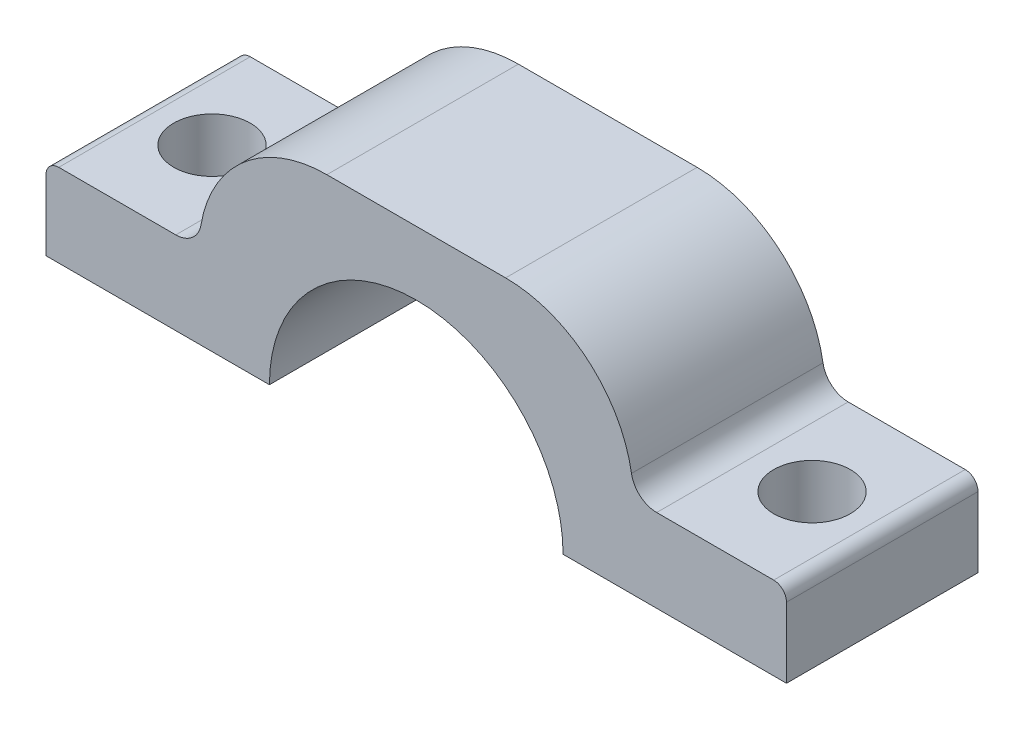
ISO-10303-21;
HEADER;
FILE_DESCRIPTION(('STEP AP214'),'2;1');
FILE_NAME('part.step','',(''),(''),'','','');
FILE_SCHEMA(('AUTOMOTIVE_DESIGN { 1 0 10303 214 1 1 1 1 }'));
ENDSEC;
DATA;
#1=APPLICATION_CONTEXT('core data for automotive mechanical design processes');
#2=APPLICATION_PROTOCOL_DEFINITION('international standard','automotive_design',2000,#1);
#3=PRODUCT_CONTEXT('',#1,'mechanical');
#4=PRODUCT('Part','Part','',(#3));
#5=PRODUCT_RELATED_PRODUCT_CATEGORY('part','',(#4));
#6=PRODUCT_DEFINITION_FORMATION('','',#4);
#7=PRODUCT_DEFINITION_CONTEXT('part definition',#1,'design');
#8=PRODUCT_DEFINITION('design','',#6,#7);
#9=PRODUCT_DEFINITION_SHAPE('','',#8);
#10=(LENGTH_UNIT() NAMED_UNIT(*) SI_UNIT(.MILLI.,.METRE.));
#11=(NAMED_UNIT(*) PLANE_ANGLE_UNIT() SI_UNIT($,.RADIAN.));
#12=(NAMED_UNIT(*) SI_UNIT($,.STERADIAN.) SOLID_ANGLE_UNIT());
#13=UNCERTAINTY_MEASURE_WITH_UNIT(LENGTH_MEASURE(1.E-05),#10,'distance_accuracy_value','');
#14=(GEOMETRIC_REPRESENTATION_CONTEXT(3) GLOBAL_UNCERTAINTY_ASSIGNED_CONTEXT((#13)) GLOBAL_UNIT_ASSIGNED_CONTEXT((#10,
#11,#12)) REPRESENTATION_CONTEXT('',''));
#15=CARTESIAN_POINT('',(0.,0.,0.));
#16=DIRECTION('',(0.,0.,1.));
#17=DIRECTION('',(1.,0.,0.));
#18=AXIS2_PLACEMENT_3D('',#15,#16,#17);
#19=CARTESIAN_POINT('',(17.,6.49999999999993,15.));
#20=DIRECTION('',(0.,-1.,0.));
#21=DIRECTION('',(1.,0.,0.));
#22=AXIS2_PLACEMENT_3D('',#19,#20,#21);
#23=PLANE('',#22);
#24=CARTESIAN_POINT('',(23.5,6.49999999999997,7.5));
#25=DIRECTION('',(0.,1.,0.));
#26=DIRECTION('',(0.,0.,1.));
#27=AXIS2_PLACEMENT_3D('',#24,#25,#26);
#28=CIRCLE('',#27,2.99999999999999);
#29=CARTESIAN_POINT('',(23.5,6.49999999999997,10.5));
#30=VERTEX_POINT('',#29);
#31=EDGE_CURVE('E286',#30,#30,#28,.T.);
#32=ORIENTED_EDGE('',*,*,#31,.F.);
#33=EDGE_LOOP('',(#32));
#34=FACE_BOUND('',#33,.T.);
#35=DIRECTION('',(-1.,0.,0.));
#36=VECTOR('',#35,1.);
#37=CARTESIAN_POINT('',(17.,6.49999999999993,15.));
#38=LINE('',#37,#36);
#39=CARTESIAN_POINT('',(28.,6.49999999999999,15.));
#40=VERTEX_POINT('',#39);
#41=CARTESIAN_POINT('',(18.8321595661993,6.49999999999994,15.));
#42=VERTEX_POINT('',#41);
#43=EDGE_CURVE('E144',#40,#42,#38,.T.);
#44=ORIENTED_EDGE('',*,*,#43,.F.);
#45=DIRECTION('',(0.,0.,-1.));
#46=VECTOR('',#45,1.);
#47=CARTESIAN_POINT('',(28.,6.49999999999999,15.));
#48=LINE('',#47,#46);
#49=CARTESIAN_POINT('',(28.,6.49999999999999,0.));
#50=VERTEX_POINT('',#49);
#51=EDGE_CURVE('E228',#40,#50,#48,.T.);
#52=ORIENTED_EDGE('',*,*,#51,.T.);
#53=DIRECTION('',(-1.,0.,0.));
#54=VECTOR('',#53,1.);
#55=CARTESIAN_POINT('',(17.,6.49999999999993,0.));
#56=LINE('',#55,#54);
#57=CARTESIAN_POINT('',(18.8321595661993,6.49999999999994,0.));
#58=VERTEX_POINT('',#57);
#59=EDGE_CURVE('E177',#50,#58,#56,.T.);
#60=ORIENTED_EDGE('',*,*,#59,.T.);
#61=DIRECTION('',(0.,0.,1.));
#62=VECTOR('',#61,1.);
#63=CARTESIAN_POINT('',(18.8321595661993,6.49999999999994,15.));
#64=LINE('',#63,#62);
#65=EDGE_CURVE('E212',#58,#42,#64,.T.);
#66=ORIENTED_EDGE('',*,*,#65,.T.);
#67=EDGE_LOOP('',(#44,#52,#60,#66));
#68=FACE_BOUND('',#67,.T.);
#69=ADVANCED_FACE('F32',(#34,#68),#23,.F.);
#70=CARTESIAN_POINT('',(7.,6.50000000000001,15.));
#71=DIRECTION('',(0.,0.,-1.));
#72=DIRECTION('',(-1.,0.,0.));
#73=AXIS2_PLACEMENT_3D('',#70,#71,#72);
#74=CYLINDRICAL_SURFACE('',#73,10.);
#75=CARTESIAN_POINT('',(7.,6.50000000000001,15.));
#76=DIRECTION('',(0.,0.,1.));
#77=DIRECTION('',(-1.,0.,0.));
#78=AXIS2_PLACEMENT_3D('',#75,#76,#77);
#79=CIRCLE('',#78,10.);
#80=CARTESIAN_POINT('',(16.8601329718327,8.16666666666662,15.));
#81=VERTEX_POINT('',#80);
#82=CARTESIAN_POINT('',(6.99999999999993,16.5,15.));
#83=VERTEX_POINT('',#82);
#84=EDGE_CURVE('E131',#81,#83,#79,.T.);
#85=ORIENTED_EDGE('',*,*,#84,.F.);
#86=DIRECTION('',(0.,0.,-1.));
#87=VECTOR('',#86,1.);
#88=CARTESIAN_POINT('',(16.8601329718327,8.16666666666662,15.));
#89=LINE('',#88,#87);
#90=CARTESIAN_POINT('',(16.8601329718327,8.16666666666662,0.));
#91=VERTEX_POINT('',#90);
#92=EDGE_CURVE('E153',#81,#91,#89,.T.);
#93=ORIENTED_EDGE('',*,*,#92,.T.);
#94=CARTESIAN_POINT('',(7.,6.50000000000001,0.));
#95=DIRECTION('',(0.,0.,1.));
#96=DIRECTION('',(-1.,0.,0.));
#97=AXIS2_PLACEMENT_3D('',#94,#95,#96);
#98=CIRCLE('',#97,10.);
#99=CARTESIAN_POINT('',(6.99999999999993,16.5,0.));
#100=VERTEX_POINT('',#99);
#101=EDGE_CURVE('E150',#91,#100,#98,.T.);
#102=ORIENTED_EDGE('',*,*,#101,.T.);
#103=DIRECTION('',(0.,0.,-1.));
#104=VECTOR('',#103,1.);
#105=CARTESIAN_POINT('',(6.99999999999993,16.5,15.));
#106=LINE('',#105,#104);
#107=EDGE_CURVE('E147',#83,#100,#106,.T.);
#108=ORIENTED_EDGE('',*,*,#107,.F.);
#109=EDGE_LOOP('',(#85,#93,#102,#108));
#110=FACE_BOUND('',#109,.T.);
#111=ADVANCED_FACE('F148',(#110),#74,.T.);
#112=CARTESIAN_POINT('',(-6.99999999999993,16.5,15.));
#113=DIRECTION('',(0.,-1.,0.));
#114=DIRECTION('',(1.,0.,0.));
#115=AXIS2_PLACEMENT_3D('',#112,#113,#114);
#116=PLANE('',#115);
#117=DIRECTION('',(-1.,0.,0.));
#118=VECTOR('',#117,1.);
#119=CARTESIAN_POINT('',(-6.99999999999993,16.5,0.));
#120=LINE('',#119,#118);
#121=CARTESIAN_POINT('',(-6.99999999999993,16.5,0.));
#122=VERTEX_POINT('',#121);
#123=EDGE_CURVE('E181',#100,#122,#120,.T.);
#124=ORIENTED_EDGE('',*,*,#123,.T.);
#125=DIRECTION('',(0.,0.,-1.));
#126=VECTOR('',#125,1.);
#127=CARTESIAN_POINT('',(-6.99999999999993,16.5,15.));
#128=LINE('',#127,#126);
#129=CARTESIAN_POINT('',(-6.99999999999993,16.5,15.));
#130=VERTEX_POINT('',#129);
#131=EDGE_CURVE('E154',#130,#122,#128,.T.);
#132=ORIENTED_EDGE('',*,*,#131,.F.);
#133=DIRECTION('',(-1.,0.,0.));
#134=VECTOR('',#133,1.);
#135=CARTESIAN_POINT('',(-6.99999999999993,16.5,15.));
#136=LINE('',#135,#134);
#137=EDGE_CURVE('E137',#83,#130,#136,.T.);
#138=ORIENTED_EDGE('',*,*,#137,.F.);
#139=ORIENTED_EDGE('',*,*,#107,.T.);
#140=EDGE_LOOP('',(#124,#132,#138,#139));
#141=FACE_BOUND('',#140,.T.);
#142=ADVANCED_FACE('F156',(#141),#116,.F.);
#143=CARTESIAN_POINT('',(-7.,6.5,15.));
#144=DIRECTION('',(0.,0.,-1.));
#145=DIRECTION('',(-1.,0.,0.));
#146=AXIS2_PLACEMENT_3D('',#143,#144,#145);
#147=CYLINDRICAL_SURFACE('',#146,10.);
#148=CARTESIAN_POINT('',(-7.,6.5,0.));
#149=DIRECTION('',(0.,0.,1.));
#150=DIRECTION('',(1.,0.,0.));
#151=AXIS2_PLACEMENT_3D('',#148,#149,#150);
#152=CIRCLE('',#151,10.);
#153=CARTESIAN_POINT('',(-16.8601329718327,8.16666666666662,0.));
#154=VERTEX_POINT('',#153);
#155=EDGE_CURVE('E183',#122,#154,#152,.T.);
#156=ORIENTED_EDGE('',*,*,#155,.T.);
#157=DIRECTION('',(0.,0.,-1.));
#158=VECTOR('',#157,1.);
#159=CARTESIAN_POINT('',(-16.8601329718327,8.16666666666662,15.));
#160=LINE('',#159,#158);
#161=CARTESIAN_POINT('',(-16.8601329718327,8.16666666666662,15.));
#162=VERTEX_POINT('',#161);
#163=EDGE_CURVE('E218',#154,#162,#160,.F.);
#164=ORIENTED_EDGE('',*,*,#163,.T.);
#165=CARTESIAN_POINT('',(-7.,6.5,15.));
#166=DIRECTION('',(0.,0.,1.));
#167=DIRECTION('',(1.,0.,0.));
#168=AXIS2_PLACEMENT_3D('',#165,#166,#167);
#169=CIRCLE('',#168,10.);
#170=EDGE_CURVE('E159',#130,#162,#169,.T.);
#171=ORIENTED_EDGE('',*,*,#170,.F.);
#172=ORIENTED_EDGE('',*,*,#131,.T.);
#173=EDGE_LOOP('',(#156,#164,#171,#172));
#174=FACE_BOUND('',#173,.T.);
#175=ADVANCED_FACE('F341',(#174),#147,.T.);
#176=CARTESIAN_POINT('',(-17.,6.49999999999993,15.));
#177=DIRECTION('',(0.,-1.,0.));
#178=DIRECTION('',(1.,0.,0.));
#179=AXIS2_PLACEMENT_3D('',#176,#177,#178);
#180=PLANE('',#179);
#181=CARTESIAN_POINT('',(-23.5,6.49999999999997,7.5));
#182=DIRECTION('',(0.,1.,0.));
#183=DIRECTION('',(0.,0.,1.));
#184=AXIS2_PLACEMENT_3D('',#181,#182,#183);
#185=CIRCLE('',#184,2.99999999999999);
#186=CARTESIAN_POINT('',(-23.5,6.49999999999997,10.5));
#187=VERTEX_POINT('',#186);
#188=EDGE_CURVE('E280',#187,#187,#185,.T.);
#189=ORIENTED_EDGE('',*,*,#188,.F.);
#190=EDGE_LOOP('',(#189));
#191=FACE_BOUND('',#190,.T.);
#192=DIRECTION('',(-1.,0.,0.));
#193=VECTOR('',#192,1.);
#194=CARTESIAN_POINT('',(-17.,6.49999999999993,0.));
#195=LINE('',#194,#193);
#196=CARTESIAN_POINT('',(-18.8321595661993,6.49999999999994,0.));
#197=VERTEX_POINT('',#196);
#198=CARTESIAN_POINT('',(-28.,6.49999999999999,0.));
#199=VERTEX_POINT('',#198);
#200=EDGE_CURVE('E186',#197,#199,#195,.T.);
#201=ORIENTED_EDGE('',*,*,#200,.T.);
#202=DIRECTION('',(0.,0.,-1.));
#203=VECTOR('',#202,1.);
#204=CARTESIAN_POINT('',(-28.,6.49999999999999,15.));
#205=LINE('',#204,#203);
#206=CARTESIAN_POINT('',(-28.,6.49999999999999,15.));
#207=VERTEX_POINT('',#206);
#208=EDGE_CURVE('E11',#199,#207,#205,.F.);
#209=ORIENTED_EDGE('',*,*,#208,.T.);
#210=DIRECTION('',(-1.,0.,0.));
#211=VECTOR('',#210,1.);
#212=CARTESIAN_POINT('',(-17.,6.49999999999993,15.));
#213=LINE('',#212,#211);
#214=CARTESIAN_POINT('',(-18.8321595661993,6.49999999999994,15.));
#215=VERTEX_POINT('',#214);
#216=EDGE_CURVE('E161',#215,#207,#213,.T.);
#217=ORIENTED_EDGE('',*,*,#216,.F.);
#218=DIRECTION('',(0.,0.,1.));
#219=VECTOR('',#218,1.);
#220=CARTESIAN_POINT('',(-18.8321595661993,6.49999999999994,0.));
#221=LINE('',#220,#219);
#222=EDGE_CURVE('E215',#215,#197,#221,.F.);
#223=ORIENTED_EDGE('',*,*,#222,.T.);
#224=EDGE_LOOP('',(#201,#209,#217,#223));
#225=FACE_BOUND('',#224,.T.);
#226=ADVANCED_FACE('F338',(#191,#225),#180,.F.);
#227=CARTESIAN_POINT('',(-29.,0.,15.));
#228=DIRECTION('',(1.,0.,0.));
#229=DIRECTION('',(0.,0.,-1.));
#230=AXIS2_PLACEMENT_3D('',#227,#228,#229);
#231=PLANE('',#230);
#232=DIRECTION('',(0.,-1.,0.));
#233=VECTOR('',#232,1.);
#234=CARTESIAN_POINT('',(-29.,0.,15.));
#235=LINE('',#234,#233);
#236=CARTESIAN_POINT('',(-29.,5.49999999999999,15.));
#237=VERTEX_POINT('',#236);
#238=CARTESIAN_POINT('',(-29.,0.,15.));
#239=VERTEX_POINT('',#238);
#240=EDGE_CURVE('E166',#237,#239,#235,.T.);
#241=ORIENTED_EDGE('',*,*,#240,.F.);
#242=DIRECTION('',(0.,0.,-1.));
#243=VECTOR('',#242,1.);
#244=CARTESIAN_POINT('',(-29.,5.49999999999999,15.));
#245=LINE('',#244,#243);
#246=CARTESIAN_POINT('',(-29.,5.49999999999999,0.));
#247=VERTEX_POINT('',#246);
#248=EDGE_CURVE('E40',#237,#247,#245,.T.);
#249=ORIENTED_EDGE('',*,*,#248,.T.);
#250=DIRECTION('',(0.,-1.,0.));
#251=VECTOR('',#250,1.);
#252=CARTESIAN_POINT('',(-29.,0.,0.));
#253=LINE('',#252,#251);
#254=CARTESIAN_POINT('',(-29.,0.,0.));
#255=VERTEX_POINT('',#254);
#256=EDGE_CURVE('E188',#247,#255,#253,.T.);
#257=ORIENTED_EDGE('',*,*,#256,.T.);
#258=DIRECTION('',(0.,0.,-1.));
#259=VECTOR('',#258,1.);
#260=CARTESIAN_POINT('',(-29.,0.,15.));
#261=LINE('',#260,#259);
#262=EDGE_CURVE('E207',#239,#255,#261,.T.);
#263=ORIENTED_EDGE('',*,*,#262,.F.);
#264=EDGE_LOOP('',(#241,#249,#257,#263));
#265=FACE_BOUND('',#264,.T.);
#266=ADVANCED_FACE('F243',(#265),#231,.F.);
#267=CARTESIAN_POINT('',(-11.5,0.,15.));
#268=DIRECTION('',(0.,1.,0.));
#269=DIRECTION('',(0.,0.,1.));
#270=AXIS2_PLACEMENT_3D('',#267,#268,#269);
#271=PLANE('',#270);
#272=CARTESIAN_POINT('',(-23.5,0.,7.5));
#273=DIRECTION('',(0.,1.,0.));
#274=DIRECTION('',(0.,0.,1.));
#275=AXIS2_PLACEMENT_3D('',#272,#273,#274);
#276=CIRCLE('',#275,3.);
#277=CARTESIAN_POINT('',(-23.5,0.,10.5));
#278=VERTEX_POINT('',#277);
#279=EDGE_CURVE('E179',#278,#278,#276,.T.);
#280=ORIENTED_EDGE('',*,*,#279,.T.);
#281=EDGE_LOOP('',(#280));
#282=FACE_BOUND('',#281,.T.);
#283=DIRECTION('',(1.,0.,0.));
#284=VECTOR('',#283,1.);
#285=CARTESIAN_POINT('',(-11.5,0.,0.));
#286=LINE('',#285,#284);
#287=CARTESIAN_POINT('',(-11.5,0.,0.));
#288=VERTEX_POINT('',#287);
#289=EDGE_CURVE('E190',#255,#288,#286,.T.);
#290=ORIENTED_EDGE('',*,*,#289,.T.);
#291=DIRECTION('',(0.,0.,-1.));
#292=VECTOR('',#291,1.);
#293=CARTESIAN_POINT('',(-11.5,0.,15.));
#294=LINE('',#293,#292);
#295=CARTESIAN_POINT('',(-11.5,0.,15.));
#296=VERTEX_POINT('',#295);
#297=EDGE_CURVE('E204',#296,#288,#294,.T.);
#298=ORIENTED_EDGE('',*,*,#297,.F.);
#299=DIRECTION('',(1.,0.,0.));
#300=VECTOR('',#299,1.);
#301=CARTESIAN_POINT('',(-11.5,0.,15.));
#302=LINE('',#301,#300);
#303=EDGE_CURVE('E168',#239,#296,#302,.T.);
#304=ORIENTED_EDGE('',*,*,#303,.F.);
#305=ORIENTED_EDGE('',*,*,#262,.T.);
#306=EDGE_LOOP('',(#290,#298,#304,#305));
#307=FACE_BOUND('',#306,.T.);
#308=ADVANCED_FACE('F255',(#282,#307),#271,.F.);
#309=CARTESIAN_POINT('',(0.,0.,15.));
#310=DIRECTION('',(0.,0.,-1.));
#311=DIRECTION('',(-1.,0.,0.));
#312=AXIS2_PLACEMENT_3D('',#309,#310,#311);
#313=CYLINDRICAL_SURFACE('',#312,11.5);
#314=CARTESIAN_POINT('',(0.,0.,0.));
#315=DIRECTION('',(0.,0.,-1.));
#316=DIRECTION('',(1.,0.,0.));
#317=AXIS2_PLACEMENT_3D('',#314,#315,#316);
#318=CIRCLE('',#317,11.5);
#319=CARTESIAN_POINT('',(11.5,0.,0.));
#320=VERTEX_POINT('',#319);
#321=EDGE_CURVE('E192',#288,#320,#318,.T.);
#322=ORIENTED_EDGE('',*,*,#321,.T.);
#323=DIRECTION('',(0.,0.,-1.));
#324=VECTOR('',#323,1.);
#325=CARTESIAN_POINT('',(11.5,0.,15.));
#326=LINE('',#325,#324);
#327=CARTESIAN_POINT('',(11.5,0.,15.));
#328=VERTEX_POINT('',#327);
#329=EDGE_CURVE('E201',#328,#320,#326,.T.);
#330=ORIENTED_EDGE('',*,*,#329,.F.);
#331=CARTESIAN_POINT('',(0.,0.,15.));
#332=DIRECTION('',(0.,0.,-1.));
#333=DIRECTION('',(1.,0.,0.));
#334=AXIS2_PLACEMENT_3D('',#331,#332,#333);
#335=CIRCLE('',#334,11.5);
#336=EDGE_CURVE('E170',#296,#328,#335,.T.);
#337=ORIENTED_EDGE('',*,*,#336,.F.);
#338=ORIENTED_EDGE('',*,*,#297,.T.);
#339=EDGE_LOOP('',(#322,#330,#337,#338));
#340=FACE_BOUND('',#339,.T.);
#341=ADVANCED_FACE('F259',(#340),#313,.F.);
#342=CARTESIAN_POINT('',(11.5,0.,15.));
#343=DIRECTION('',(0.,1.,0.));
#344=DIRECTION('',(0.,0.,1.));
#345=AXIS2_PLACEMENT_3D('',#342,#343,#344);
#346=PLANE('',#345);
#347=CARTESIAN_POINT('',(23.5,0.,7.5));
#348=DIRECTION('',(0.,1.,0.));
#349=DIRECTION('',(0.,0.,1.));
#350=AXIS2_PLACEMENT_3D('',#347,#348,#349);
#351=CIRCLE('',#350,3.);
#352=CARTESIAN_POINT('',(23.5,0.,10.5));
#353=VERTEX_POINT('',#352);
#354=EDGE_CURVE('E283',#353,#353,#351,.T.);
#355=ORIENTED_EDGE('',*,*,#354,.T.);
#356=EDGE_LOOP('',(#355));
#357=FACE_BOUND('',#356,.T.);
#358=DIRECTION('',(1.,0.,0.));
#359=VECTOR('',#358,1.);
#360=CARTESIAN_POINT('',(11.5,0.,0.));
#361=LINE('',#360,#359);
#362=CARTESIAN_POINT('',(29.,0.,0.));
#363=VERTEX_POINT('',#362);
#364=EDGE_CURVE('E194',#320,#363,#361,.T.);
#365=ORIENTED_EDGE('',*,*,#364,.T.);
#366=DIRECTION('',(0.,0.,-1.));
#367=VECTOR('',#366,1.);
#368=CARTESIAN_POINT('',(29.,0.,15.));
#369=LINE('',#368,#367);
#370=CARTESIAN_POINT('',(29.,0.,15.));
#371=VERTEX_POINT('',#370);
#372=EDGE_CURVE('E176',#371,#363,#369,.T.);
#373=ORIENTED_EDGE('',*,*,#372,.F.);
#374=DIRECTION('',(1.,0.,0.));
#375=VECTOR('',#374,1.);
#376=CARTESIAN_POINT('',(11.5,0.,15.));
#377=LINE('',#376,#375);
#378=EDGE_CURVE('E172',#328,#371,#377,.T.);
#379=ORIENTED_EDGE('',*,*,#378,.F.);
#380=ORIENTED_EDGE('',*,*,#329,.T.);
#381=EDGE_LOOP('',(#365,#373,#379,#380));
#382=FACE_BOUND('',#381,.T.);
#383=ADVANCED_FACE('F266',(#357,#382),#346,.F.);
#384=CARTESIAN_POINT('',(29.,0.,15.));
#385=DIRECTION('',(-1.,0.,0.));
#386=DIRECTION('',(0.,0.,1.));
#387=AXIS2_PLACEMENT_3D('',#384,#385,#386);
#388=PLANE('',#387);
#389=DIRECTION('',(0.,1.,0.));
#390=VECTOR('',#389,1.);
#391=CARTESIAN_POINT('',(29.,0.,0.));
#392=LINE('',#391,#390);
#393=CARTESIAN_POINT('',(29.,5.49999999999999,0.));
#394=VERTEX_POINT('',#393);
#395=EDGE_CURVE('E196',#363,#394,#392,.T.);
#396=ORIENTED_EDGE('',*,*,#395,.T.);
#397=DIRECTION('',(0.,0.,-1.));
#398=VECTOR('',#397,1.);
#399=CARTESIAN_POINT('',(29.,5.49999999999999,15.));
#400=LINE('',#399,#398);
#401=CARTESIAN_POINT('',(29.,5.49999999999999,15.));
#402=VERTEX_POINT('',#401);
#403=EDGE_CURVE('E235',#394,#402,#400,.F.);
#404=ORIENTED_EDGE('',*,*,#403,.T.);
#405=DIRECTION('',(0.,1.,0.));
#406=VECTOR('',#405,1.);
#407=CARTESIAN_POINT('',(29.,0.,15.));
#408=LINE('',#407,#406);
#409=EDGE_CURVE('E174',#371,#402,#408,.T.);
#410=ORIENTED_EDGE('',*,*,#409,.F.);
#411=ORIENTED_EDGE('',*,*,#372,.T.);
#412=EDGE_LOOP('',(#396,#404,#410,#411));
#413=FACE_BOUND('',#412,.T.);
#414=ADVANCED_FACE('F269',(#413),#388,.F.);
#415=CARTESIAN_POINT('',(0.,0.,15.));
#416=DIRECTION('',(0.,0.,1.));
#417=DIRECTION('',(1.,0.,0.));
#418=AXIS2_PLACEMENT_3D('',#415,#416,#417);
#419=PLANE('',#418);
#420=ORIENTED_EDGE('',*,*,#409,.T.);
#421=CARTESIAN_POINT('',(28.,5.49999999999999,15.));
#422=DIRECTION('',(0.,0.,1.));
#423=DIRECTION('',(1.,0.,0.));
#424=AXIS2_PLACEMENT_3D('',#421,#422,#423);
#425=CIRCLE('',#424,1.);
#426=EDGE_CURVE('E238',#402,#40,#425,.T.);
#427=ORIENTED_EDGE('',*,*,#426,.T.);
#428=ORIENTED_EDGE('',*,*,#43,.T.);
#429=CARTESIAN_POINT('',(18.8321595661992,8.49999999999994,15.));
#430=DIRECTION('',(0.,0.,1.));
#431=DIRECTION('',(1.,0.,0.));
#432=AXIS2_PLACEMENT_3D('',#429,#430,#431);
#433=CIRCLE('',#432,2.);
#434=EDGE_CURVE('E140',#42,#81,#433,.F.);
#435=ORIENTED_EDGE('',*,*,#434,.T.);
#436=ORIENTED_EDGE('',*,*,#84,.T.);
#437=ORIENTED_EDGE('',*,*,#137,.T.);
#438=ORIENTED_EDGE('',*,*,#170,.T.);
#439=CARTESIAN_POINT('',(-18.8321595661992,8.49999999999994,15.));
#440=DIRECTION('',(0.,0.,1.));
#441=DIRECTION('',(1.,0.,0.));
#442=AXIS2_PLACEMENT_3D('',#439,#440,#441);
#443=CIRCLE('',#442,2.);
#444=EDGE_CURVE('E226',#162,#215,#443,.F.);
#445=ORIENTED_EDGE('',*,*,#444,.T.);
#446=ORIENTED_EDGE('',*,*,#216,.T.);
#447=CARTESIAN_POINT('',(-28.,5.49999999999999,15.));
#448=DIRECTION('',(0.,0.,1.));
#449=DIRECTION('',(1.,0.,0.));
#450=AXIS2_PLACEMENT_3D('',#447,#448,#449);
#451=CIRCLE('',#450,1.);
#452=EDGE_CURVE('E47',#207,#237,#451,.T.);
#453=ORIENTED_EDGE('',*,*,#452,.T.);
#454=ORIENTED_EDGE('',*,*,#240,.T.);
#455=ORIENTED_EDGE('',*,*,#303,.T.);
#456=ORIENTED_EDGE('',*,*,#336,.T.);
#457=ORIENTED_EDGE('',*,*,#378,.T.);
#458=EDGE_LOOP('',(#420,#427,#428,#435,#436,#437,#438,#445,#446,#453,#454,#455,#456,#457));
#459=FACE_BOUND('',#458,.T.);
#460=ADVANCED_FACE('F134',(#459),#419,.T.);
#461=CARTESIAN_POINT('',(0.,0.,0.));
#462=DIRECTION('',(0.,0.,1.));
#463=DIRECTION('',(1.,0.,0.));
#464=AXIS2_PLACEMENT_3D('',#461,#462,#463);
#465=PLANE('',#464);
#466=ORIENTED_EDGE('',*,*,#59,.F.);
#467=CARTESIAN_POINT('',(28.,5.49999999999999,0.));
#468=DIRECTION('',(0.,0.,1.));
#469=DIRECTION('',(1.,0.,0.));
#470=AXIS2_PLACEMENT_3D('',#467,#468,#469);
#471=CIRCLE('',#470,1.);
#472=EDGE_CURVE('E233',#50,#394,#471,.F.);
#473=ORIENTED_EDGE('',*,*,#472,.T.);
#474=ORIENTED_EDGE('',*,*,#395,.F.);
#475=ORIENTED_EDGE('',*,*,#364,.F.);
#476=ORIENTED_EDGE('',*,*,#321,.F.);
#477=ORIENTED_EDGE('',*,*,#289,.F.);
#478=ORIENTED_EDGE('',*,*,#256,.F.);
#479=CARTESIAN_POINT('',(-28.,5.49999999999999,0.));
#480=DIRECTION('',(0.,0.,1.));
#481=DIRECTION('',(1.,0.,0.));
#482=AXIS2_PLACEMENT_3D('',#479,#480,#481);
#483=CIRCLE('',#482,1.);
#484=EDGE_CURVE('E231',#247,#199,#483,.F.);
#485=ORIENTED_EDGE('',*,*,#484,.T.);
#486=ORIENTED_EDGE('',*,*,#200,.F.);
#487=CARTESIAN_POINT('',(-18.8321595661992,8.49999999999994,0.));
#488=DIRECTION('',(0.,0.,1.));
#489=DIRECTION('',(1.,0.,0.));
#490=AXIS2_PLACEMENT_3D('',#487,#488,#489);
#491=CIRCLE('',#490,2.);
#492=EDGE_CURVE('E224',#197,#154,#491,.T.);
#493=ORIENTED_EDGE('',*,*,#492,.T.);
#494=ORIENTED_EDGE('',*,*,#155,.F.);
#495=ORIENTED_EDGE('',*,*,#123,.F.);
#496=ORIENTED_EDGE('',*,*,#101,.F.);
#497=CARTESIAN_POINT('',(18.8321595661992,8.49999999999994,0.));
#498=DIRECTION('',(0.,0.,1.));
#499=DIRECTION('',(1.,0.,0.));
#500=AXIS2_PLACEMENT_3D('',#497,#498,#499);
#501=CIRCLE('',#500,2.);
#502=EDGE_CURVE('E220',#91,#58,#501,.T.);
#503=ORIENTED_EDGE('',*,*,#502,.T.);
#504=EDGE_LOOP('',(#466,#473,#474,#475,#476,#477,#478,#485,#486,#493,#494,#495,#496,#503));
#505=FACE_BOUND('',#504,.T.);
#506=ADVANCED_FACE('F249',(#505),#465,.F.);
#507=CARTESIAN_POINT('',(18.8321595661992,8.49999999999994,15.));
#508=DIRECTION('',(0.,0.,-1.));
#509=DIRECTION('',(-1.,0.,0.));
#510=AXIS2_PLACEMENT_3D('',#507,#508,#509);
#511=CYLINDRICAL_SURFACE('',#510,2.);
#512=ORIENTED_EDGE('',*,*,#434,.F.);
#513=ORIENTED_EDGE('',*,*,#65,.F.);
#514=ORIENTED_EDGE('',*,*,#502,.F.);
#515=ORIENTED_EDGE('',*,*,#92,.F.);
#516=EDGE_LOOP('',(#512,#513,#514,#515));
#517=FACE_BOUND('',#516,.T.);
#518=ADVANCED_FACE('F300',(#517),#511,.F.);
#519=CARTESIAN_POINT('',(-18.8321595661992,8.49999999999994,15.));
#520=DIRECTION('',(0.,0.,-1.));
#521=DIRECTION('',(-1.,0.,0.));
#522=AXIS2_PLACEMENT_3D('',#519,#520,#521);
#523=CYLINDRICAL_SURFACE('',#522,2.);
#524=ORIENTED_EDGE('',*,*,#444,.F.);
#525=ORIENTED_EDGE('',*,*,#163,.F.);
#526=ORIENTED_EDGE('',*,*,#492,.F.);
#527=ORIENTED_EDGE('',*,*,#222,.F.);
#528=EDGE_LOOP('',(#524,#525,#526,#527));
#529=FACE_BOUND('',#528,.T.);
#530=ADVANCED_FACE('F303',(#529),#523,.F.);
#531=CARTESIAN_POINT('',(-23.5,6.49999999999997,7.5));
#532=DIRECTION('',(0.,1.,0.));
#533=DIRECTION('',(0.,0.,1.));
#534=AXIS2_PLACEMENT_3D('',#531,#532,#533);
#535=CYLINDRICAL_SURFACE('',#534,2.99999999999999);
#536=ORIENTED_EDGE('',*,*,#279,.F.);
#537=EDGE_LOOP('',(#536));
#538=FACE_BOUND('',#537,.T.);
#539=ORIENTED_EDGE('',*,*,#188,.T.);
#540=EDGE_LOOP('',(#539));
#541=FACE_BOUND('',#540,.T.);
#542=ADVANCED_FACE('F306',(#538,#541),#535,.F.);
#543=CARTESIAN_POINT('',(23.5,6.49999999999997,7.5));
#544=DIRECTION('',(0.,1.,0.));
#545=DIRECTION('',(0.,0.,1.));
#546=AXIS2_PLACEMENT_3D('',#543,#544,#545);
#547=CYLINDRICAL_SURFACE('',#546,2.99999999999999);
#548=ORIENTED_EDGE('',*,*,#354,.F.);
#549=EDGE_LOOP('',(#548));
#550=FACE_BOUND('',#549,.T.);
#551=ORIENTED_EDGE('',*,*,#31,.T.);
#552=EDGE_LOOP('',(#551));
#553=FACE_BOUND('',#552,.T.);
#554=ADVANCED_FACE('F290',(#550,#553),#547,.F.);
#555=CARTESIAN_POINT('',(28.,5.49999999999999,15.));
#556=DIRECTION('',(0.,0.,-1.));
#557=DIRECTION('',(-1.,0.,0.));
#558=AXIS2_PLACEMENT_3D('',#555,#556,#557);
#559=CYLINDRICAL_SURFACE('',#558,1.);
#560=ORIENTED_EDGE('',*,*,#426,.F.);
#561=ORIENTED_EDGE('',*,*,#403,.F.);
#562=ORIENTED_EDGE('',*,*,#472,.F.);
#563=ORIENTED_EDGE('',*,*,#51,.F.);
#564=EDGE_LOOP('',(#560,#561,#562,#563));
#565=FACE_BOUND('',#564,.T.);
#566=ADVANCED_FACE('F272',(#565),#559,.T.);
#567=CARTESIAN_POINT('',(-28.,5.49999999999999,15.));
#568=DIRECTION('',(0.,0.,-1.));
#569=DIRECTION('',(-1.,0.,0.));
#570=AXIS2_PLACEMENT_3D('',#567,#568,#569);
#571=CYLINDRICAL_SURFACE('',#570,1.);
#572=ORIENTED_EDGE('',*,*,#452,.F.);
#573=ORIENTED_EDGE('',*,*,#208,.F.);
#574=ORIENTED_EDGE('',*,*,#484,.F.);
#575=ORIENTED_EDGE('',*,*,#248,.F.);
#576=EDGE_LOOP('',(#572,#573,#574,#575));
#577=FACE_BOUND('',#576,.T.);
#578=ADVANCED_FACE('F34',(#577),#571,.T.);
#579=CLOSED_SHELL('',(#69,#111,#142,#175,#226,#266,#308,#341,#383,#414,#460,#506,#518,#530,#542,
#554,#566,#578));
#580=MANIFOLD_SOLID_BREP('B2',#579);
#581=ADVANCED_BREP_SHAPE_REPRESENTATION('',(#18,#580),#14);
#582=SHAPE_DEFINITION_REPRESENTATION(#9,#581);
ENDSEC;
END-ISO-10303-21;
